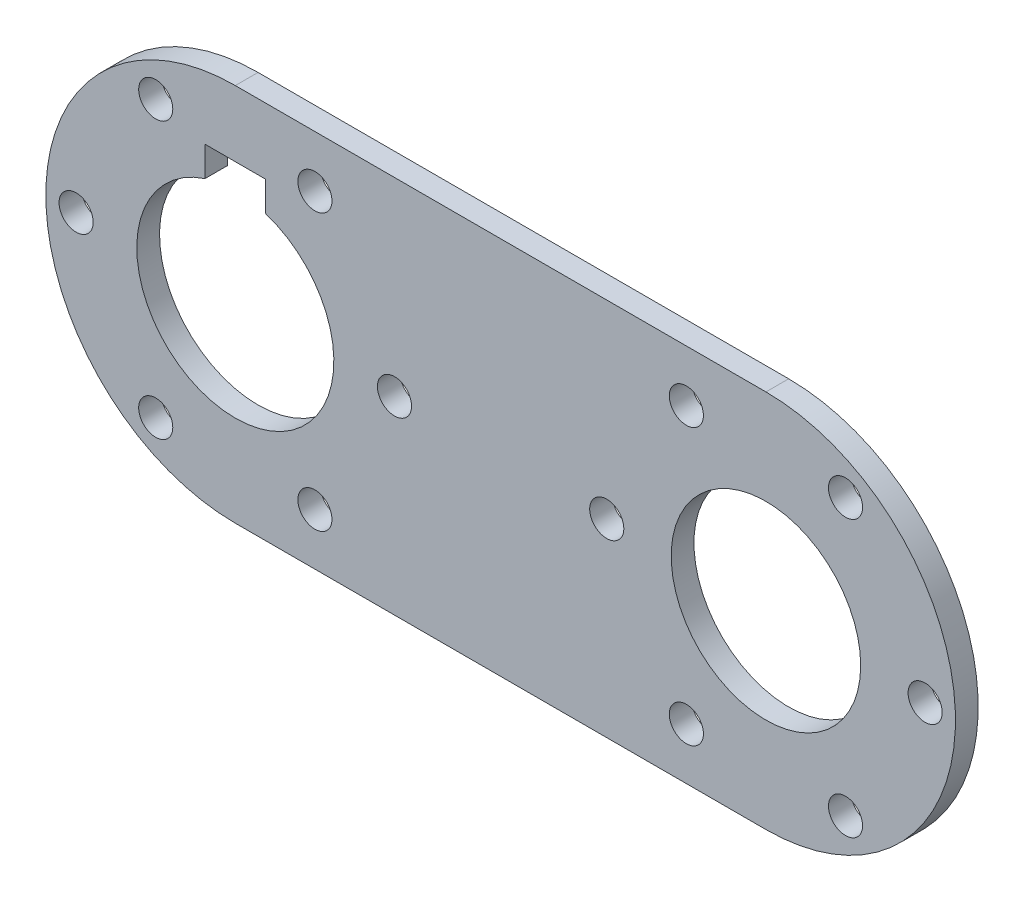
ISO-10303-21;
HEADER;
FILE_DESCRIPTION(('STEP AP214'),'2;1');
FILE_NAME('part.step','',(''),(''),'','','');
FILE_SCHEMA(('AUTOMOTIVE_DESIGN { 1 0 10303 214 1 1 1 1 }'));
ENDSEC;
DATA;
#1=APPLICATION_CONTEXT('core data for automotive mechanical design processes');
#2=APPLICATION_PROTOCOL_DEFINITION('international standard','automotive_design',2000,#1);
#3=PRODUCT_CONTEXT('',#1,'mechanical');
#4=PRODUCT('Part','Part','',(#3));
#5=PRODUCT_RELATED_PRODUCT_CATEGORY('part','',(#4));
#6=PRODUCT_DEFINITION_FORMATION('','',#4);
#7=PRODUCT_DEFINITION_CONTEXT('part definition',#1,'design');
#8=PRODUCT_DEFINITION('design','',#6,#7);
#9=PRODUCT_DEFINITION_SHAPE('','',#8);
#10=(LENGTH_UNIT() NAMED_UNIT(*) SI_UNIT(.MILLI.,.METRE.));
#11=(NAMED_UNIT(*) PLANE_ANGLE_UNIT() SI_UNIT($,.RADIAN.));
#12=(NAMED_UNIT(*) SI_UNIT($,.STERADIAN.) SOLID_ANGLE_UNIT());
#13=UNCERTAINTY_MEASURE_WITH_UNIT(LENGTH_MEASURE(1.E-05),#10,'distance_accuracy_value','');
#14=(GEOMETRIC_REPRESENTATION_CONTEXT(3) GLOBAL_UNCERTAINTY_ASSIGNED_CONTEXT((#13)) GLOBAL_UNIT_ASSIGNED_CONTEXT((#10,
#11,#12)) REPRESENTATION_CONTEXT('',''));
#15=CARTESIAN_POINT('',(0.,0.,0.));
#16=DIRECTION('',(0.,0.,1.));
#17=DIRECTION('',(1.,0.,0.));
#18=AXIS2_PLACEMENT_3D('',#15,#16,#17);
#19=CARTESIAN_POINT('',(0.,-25.,3.));
#20=DIRECTION('',(0.,-1.,0.));
#21=DIRECTION('',(1.,0.,0.));
#22=AXIS2_PLACEMENT_3D('',#19,#20,#21);
#23=PLANE('',#22);
#24=DIRECTION('',(-1.,0.,0.));
#25=VECTOR('',#24,1.);
#26=CARTESIAN_POINT('',(0.,-25.,0.));
#27=LINE('',#26,#25);
#28=CARTESIAN_POINT('',(70.,-25.,0.));
#29=VERTEX_POINT('',#28);
#30=CARTESIAN_POINT('',(0.,-25.,0.));
#31=VERTEX_POINT('',#30);
#32=EDGE_CURVE('E208',#29,#31,#27,.T.);
#33=ORIENTED_EDGE('',*,*,#32,.F.);
#34=DIRECTION('',(0.,0.,-1.));
#35=VECTOR('',#34,1.);
#36=CARTESIAN_POINT('',(70.,-25.,3.));
#37=LINE('',#36,#35);
#38=CARTESIAN_POINT('',(70.,-25.,3.));
#39=VERTEX_POINT('',#38);
#40=EDGE_CURVE('E11',#39,#29,#37,.T.);
#41=ORIENTED_EDGE('',*,*,#40,.F.);
#42=DIRECTION('',(-1.,0.,0.));
#43=VECTOR('',#42,1.);
#44=CARTESIAN_POINT('',(0.,-25.,3.));
#45=LINE('',#44,#43);
#46=CARTESIAN_POINT('',(0.,-25.,3.));
#47=VERTEX_POINT('',#46);
#48=EDGE_CURVE('E209',#39,#47,#45,.T.);
#49=ORIENTED_EDGE('',*,*,#48,.T.);
#50=DIRECTION('',(0.,0.,-1.));
#51=VECTOR('',#50,1.);
#52=CARTESIAN_POINT('',(0.,-25.,3.));
#53=LINE('',#52,#51);
#54=EDGE_CURVE('E223',#47,#31,#53,.T.);
#55=ORIENTED_EDGE('',*,*,#54,.T.);
#56=EDGE_LOOP('',(#33,#41,#49,#55));
#57=FACE_BOUND('',#56,.T.);
#58=ADVANCED_FACE('F37',(#57),#23,.T.);
#59=CARTESIAN_POINT('',(70.,0.,3.));
#60=DIRECTION('',(0.,0.,-1.));
#61=DIRECTION('',(-1.,0.,0.));
#62=AXIS2_PLACEMENT_3D('',#59,#60,#61);
#63=CYLINDRICAL_SURFACE('',#62,25.);
#64=CARTESIAN_POINT('',(70.,0.,0.));
#65=DIRECTION('',(0.,0.,1.));
#66=DIRECTION('',(1.,0.,0.));
#67=AXIS2_PLACEMENT_3D('',#64,#65,#66);
#68=CIRCLE('',#67,25.);
#69=CARTESIAN_POINT('',(70.,25.,0.));
#70=VERTEX_POINT('',#69);
#71=EDGE_CURVE('E226',#29,#70,#68,.T.);
#72=ORIENTED_EDGE('',*,*,#71,.T.);
#73=DIRECTION('',(0.,0.,-1.));
#74=VECTOR('',#73,1.);
#75=CARTESIAN_POINT('',(70.,25.,3.));
#76=LINE('',#75,#74);
#77=CARTESIAN_POINT('',(70.,25.,3.));
#78=VERTEX_POINT('',#77);
#79=EDGE_CURVE('E44',#78,#70,#76,.T.);
#80=ORIENTED_EDGE('',*,*,#79,.F.);
#81=CARTESIAN_POINT('',(70.,0.,3.));
#82=DIRECTION('',(0.,0.,1.));
#83=DIRECTION('',(1.,0.,0.));
#84=AXIS2_PLACEMENT_3D('',#81,#82,#83);
#85=CIRCLE('',#84,25.);
#86=EDGE_CURVE('E212',#39,#78,#85,.T.);
#87=ORIENTED_EDGE('',*,*,#86,.F.);
#88=ORIENTED_EDGE('',*,*,#40,.T.);
#89=EDGE_LOOP('',(#72,#80,#87,#88));
#90=FACE_BOUND('',#89,.T.);
#91=ADVANCED_FACE('F247',(#90),#63,.T.);
#92=CARTESIAN_POINT('',(0.,25.,3.));
#93=DIRECTION('',(0.,1.,0.));
#94=DIRECTION('',(-1.,0.,0.));
#95=AXIS2_PLACEMENT_3D('',#92,#93,#94);
#96=PLANE('',#95);
#97=DIRECTION('',(1.,0.,0.));
#98=VECTOR('',#97,1.);
#99=CARTESIAN_POINT('',(0.,25.,0.));
#100=LINE('',#99,#98);
#101=CARTESIAN_POINT('',(0.,25.,0.));
#102=VERTEX_POINT('',#101);
#103=EDGE_CURVE('E229',#102,#70,#100,.T.);
#104=ORIENTED_EDGE('',*,*,#103,.F.);
#105=DIRECTION('',(0.,0.,-1.));
#106=VECTOR('',#105,1.);
#107=CARTESIAN_POINT('',(0.,25.,3.));
#108=LINE('',#107,#106);
#109=CARTESIAN_POINT('',(0.,25.,3.));
#110=VERTEX_POINT('',#109);
#111=EDGE_CURVE('E238',#110,#102,#108,.T.);
#112=ORIENTED_EDGE('',*,*,#111,.F.);
#113=DIRECTION('',(1.,0.,0.));
#114=VECTOR('',#113,1.);
#115=CARTESIAN_POINT('',(0.,25.,3.));
#116=LINE('',#115,#114);
#117=EDGE_CURVE('E215',#110,#78,#116,.T.);
#118=ORIENTED_EDGE('',*,*,#117,.T.);
#119=ORIENTED_EDGE('',*,*,#79,.T.);
#120=EDGE_LOOP('',(#104,#112,#118,#119));
#121=FACE_BOUND('',#120,.T.);
#122=ADVANCED_FACE('F242',(#121),#96,.T.);
#123=CARTESIAN_POINT('',(0.,0.,3.));
#124=DIRECTION('',(0.,0.,-1.));
#125=DIRECTION('',(-1.,0.,0.));
#126=AXIS2_PLACEMENT_3D('',#123,#124,#125);
#127=CYLINDRICAL_SURFACE('',#126,25.);
#128=CARTESIAN_POINT('',(0.,0.,0.));
#129=DIRECTION('',(0.,0.,1.));
#130=DIRECTION('',(1.,0.,0.));
#131=AXIS2_PLACEMENT_3D('',#128,#129,#130);
#132=CIRCLE('',#131,25.);
#133=EDGE_CURVE('E232',#102,#31,#132,.T.);
#134=ORIENTED_EDGE('',*,*,#133,.T.);
#135=ORIENTED_EDGE('',*,*,#54,.F.);
#136=CARTESIAN_POINT('',(0.,0.,3.));
#137=DIRECTION('',(0.,0.,1.));
#138=DIRECTION('',(1.,0.,0.));
#139=AXIS2_PLACEMENT_3D('',#136,#137,#138);
#140=CIRCLE('',#139,25.);
#141=EDGE_CURVE('E218',#110,#47,#140,.T.);
#142=ORIENTED_EDGE('',*,*,#141,.F.);
#143=ORIENTED_EDGE('',*,*,#111,.T.);
#144=EDGE_LOOP('',(#134,#135,#142,#143));
#145=FACE_BOUND('',#144,.T.);
#146=ADVANCED_FACE('F254',(#145),#127,.T.);
#147=CARTESIAN_POINT('',(70.,0.,3.));
#148=DIRECTION('',(0.,0.,-1.));
#149=DIRECTION('',(-1.,0.,0.));
#150=AXIS2_PLACEMENT_3D('',#147,#148,#149);
#151=CYLINDRICAL_SURFACE('',#150,12.5);
#152=CARTESIAN_POINT('',(70.,0.,3.));
#153=DIRECTION('',(0.,0.,1.));
#154=DIRECTION('',(1.,0.,0.));
#155=AXIS2_PLACEMENT_3D('',#152,#153,#154);
#156=CIRCLE('',#155,12.5);
#157=CARTESIAN_POINT('',(82.5,0.,3.));
#158=VERTEX_POINT('',#157);
#159=EDGE_CURVE('E220',#158,#158,#156,.T.);
#160=ORIENTED_EDGE('',*,*,#159,.T.);
#161=EDGE_LOOP('',(#160));
#162=FACE_BOUND('',#161,.T.);
#163=CARTESIAN_POINT('',(70.,0.,0.));
#164=DIRECTION('',(0.,0.,1.));
#165=DIRECTION('',(1.,0.,0.));
#166=AXIS2_PLACEMENT_3D('',#163,#164,#165);
#167=CIRCLE('',#166,12.5);
#168=CARTESIAN_POINT('',(82.5,0.,0.));
#169=VERTEX_POINT('',#168);
#170=EDGE_CURVE('E213',#169,#169,#167,.T.);
#171=ORIENTED_EDGE('',*,*,#170,.F.);
#172=EDGE_LOOP('',(#171));
#173=FACE_BOUND('',#172,.T.);
#174=ADVANCED_FACE('F272',(#162,#173),#151,.F.);
#175=CARTESIAN_POINT('',(0.,0.,3.));
#176=DIRECTION('',(0.,0.,1.));
#177=DIRECTION('',(1.,0.,0.));
#178=AXIS2_PLACEMENT_3D('',#175,#176,#177);
#179=PLANE('',#178);
#180=DIRECTION('',(-1.,0.,0.));
#181=VECTOR('',#180,1.);
#182=CARTESIAN_POINT('',(3.99999999999999,16.3,3.));
#183=LINE('',#182,#181);
#184=CARTESIAN_POINT('',(3.99999999999999,16.3,3.));
#185=VERTEX_POINT('',#184);
#186=CARTESIAN_POINT('',(-4.00000000000001,16.3,3.));
#187=VERTEX_POINT('',#186);
#188=EDGE_CURVE('E51',#185,#187,#183,.T.);
#189=ORIENTED_EDGE('',*,*,#188,.F.);
#190=DIRECTION('',(0.,-1.,0.));
#191=VECTOR('',#190,1.);
#192=CARTESIAN_POINT('',(3.99999999999999,16.3,3.));
#193=LINE('',#192,#191);
#194=CARTESIAN_POINT('',(4.,12.369316876853,3.));
#195=VERTEX_POINT('',#194);
#196=EDGE_CURVE('E118',#185,#195,#193,.T.);
#197=ORIENTED_EDGE('',*,*,#196,.T.);
#198=CARTESIAN_POINT('',(0.,0.,3.));
#199=DIRECTION('',(0.,0.,1.));
#200=DIRECTION('',(1.,0.,0.));
#201=AXIS2_PLACEMENT_3D('',#198,#199,#200);
#202=CIRCLE('',#201,13.);
#203=CARTESIAN_POINT('',(-4.00000000000001,12.369316876853,3.));
#204=VERTEX_POINT('',#203);
#205=EDGE_CURVE('E121',#204,#195,#202,.T.);
#206=ORIENTED_EDGE('',*,*,#205,.F.);
#207=DIRECTION('',(0.,1.,0.));
#208=VECTOR('',#207,1.);
#209=CARTESIAN_POINT('',(-4.00000000000001,12.369316876853,3.));
#210=LINE('',#209,#208);
#211=EDGE_CURVE('E127',#204,#187,#210,.T.);
#212=ORIENTED_EDGE('',*,*,#211,.T.);
#213=EDGE_LOOP('',(#189,#197,#206,#212));
#214=FACE_BOUND('',#213,.T.);
#215=CARTESIAN_POINT('',(-21.,0.,3.));
#216=DIRECTION('',(0.,0.,1.));
#217=DIRECTION('',(1.,0.,0.));
#218=AXIS2_PLACEMENT_3D('',#215,#216,#217);
#219=CIRCLE('',#218,2.25);
#220=CARTESIAN_POINT('',(-18.75,0.,3.));
#221=VERTEX_POINT('',#220);
#222=EDGE_CURVE('E133',#221,#221,#219,.T.);
#223=ORIENTED_EDGE('',*,*,#222,.F.);
#224=EDGE_LOOP('',(#223));
#225=FACE_BOUND('',#224,.T.);
#226=CARTESIAN_POINT('',(91.,0.,3.));
#227=DIRECTION('',(0.,0.,1.));
#228=DIRECTION('',(1.,0.,0.));
#229=AXIS2_PLACEMENT_3D('',#226,#227,#228);
#230=CIRCLE('',#229,2.25);
#231=CARTESIAN_POINT('',(93.25,0.,3.));
#232=VERTEX_POINT('',#231);
#233=EDGE_CURVE('E142',#232,#232,#230,.T.);
#234=ORIENTED_EDGE('',*,*,#233,.F.);
#235=EDGE_LOOP('',(#234));
#236=FACE_BOUND('',#235,.T.);
#237=CARTESIAN_POINT('',(-10.5,18.1865334794732,3.));
#238=DIRECTION('',(0.,0.,1.));
#239=DIRECTION('',(1.,0.,0.));
#240=AXIS2_PLACEMENT_3D('',#237,#238,#239);
#241=CIRCLE('',#240,2.25);
#242=CARTESIAN_POINT('',(-8.24999999999996,18.1865334794732,3.));
#243=VERTEX_POINT('',#242);
#244=EDGE_CURVE('E148',#243,#243,#241,.T.);
#245=ORIENTED_EDGE('',*,*,#244,.F.);
#246=EDGE_LOOP('',(#245));
#247=FACE_BOUND('',#246,.T.);
#248=CARTESIAN_POINT('',(10.5000000000001,18.1865334794732,3.));
#249=DIRECTION('',(0.,0.,1.));
#250=DIRECTION('',(1.,0.,0.));
#251=AXIS2_PLACEMENT_3D('',#248,#249,#250);
#252=CIRCLE('',#251,2.25);
#253=CARTESIAN_POINT('',(12.7500000000001,18.1865334794732,3.));
#254=VERTEX_POINT('',#253);
#255=EDGE_CURVE('E154',#254,#254,#252,.T.);
#256=ORIENTED_EDGE('',*,*,#255,.F.);
#257=EDGE_LOOP('',(#256));
#258=FACE_BOUND('',#257,.T.);
#259=CARTESIAN_POINT('',(21.,-1.46642216231412E-13,3.));
#260=DIRECTION('',(0.,0.,1.));
#261=DIRECTION('',(1.,0.,0.));
#262=AXIS2_PLACEMENT_3D('',#259,#260,#261);
#263=CIRCLE('',#262,2.25);
#264=CARTESIAN_POINT('',(23.25,-1.46642216231412E-13,3.));
#265=VERTEX_POINT('',#264);
#266=EDGE_CURVE('E160',#265,#265,#263,.T.);
#267=ORIENTED_EDGE('',*,*,#266,.F.);
#268=EDGE_LOOP('',(#267));
#269=FACE_BOUND('',#268,.T.);
#270=CARTESIAN_POINT('',(10.4999999999998,-18.1865334794733,3.));
#271=DIRECTION('',(0.,0.,1.));
#272=DIRECTION('',(1.,0.,0.));
#273=AXIS2_PLACEMENT_3D('',#270,#271,#272);
#274=CIRCLE('',#273,2.25);
#275=CARTESIAN_POINT('',(12.7499999999998,-18.1865334794733,3.));
#276=VERTEX_POINT('',#275);
#277=EDGE_CURVE('E166',#276,#276,#274,.T.);
#278=ORIENTED_EDGE('',*,*,#277,.F.);
#279=EDGE_LOOP('',(#278));
#280=FACE_BOUND('',#279,.T.);
#281=CARTESIAN_POINT('',(-10.5000000000002,-18.1865334794731,3.));
#282=DIRECTION('',(0.,0.,1.));
#283=DIRECTION('',(1.,0.,0.));
#284=AXIS2_PLACEMENT_3D('',#281,#282,#283);
#285=CIRCLE('',#284,2.25);
#286=CARTESIAN_POINT('',(-8.25000000000021,-18.1865334794731,3.));
#287=VERTEX_POINT('',#286);
#288=EDGE_CURVE('E172',#287,#287,#285,.T.);
#289=ORIENTED_EDGE('',*,*,#288,.F.);
#290=EDGE_LOOP('',(#289));
#291=FACE_BOUND('',#290,.T.);
#292=CARTESIAN_POINT('',(80.5,-18.1865334794732,3.));
#293=DIRECTION('',(0.,0.,1.));
#294=DIRECTION('',(1.,0.,0.));
#295=AXIS2_PLACEMENT_3D('',#292,#293,#294);
#296=CIRCLE('',#295,2.25);
#297=CARTESIAN_POINT('',(82.75,-18.1865334794732,3.));
#298=VERTEX_POINT('',#297);
#299=EDGE_CURVE('E178',#298,#298,#296,.T.);
#300=ORIENTED_EDGE('',*,*,#299,.F.);
#301=EDGE_LOOP('',(#300));
#302=FACE_BOUND('',#301,.T.);
#303=CARTESIAN_POINT('',(59.4999999999999,-18.1865334794732,3.));
#304=DIRECTION('',(0.,0.,1.));
#305=DIRECTION('',(1.,0.,0.));
#306=AXIS2_PLACEMENT_3D('',#303,#304,#305);
#307=CIRCLE('',#306,2.25);
#308=CARTESIAN_POINT('',(61.7499999999999,-18.1865334794732,3.));
#309=VERTEX_POINT('',#308);
#310=EDGE_CURVE('E184',#309,#309,#307,.T.);
#311=ORIENTED_EDGE('',*,*,#310,.F.);
#312=EDGE_LOOP('',(#311));
#313=FACE_BOUND('',#312,.T.);
#314=CARTESIAN_POINT('',(49.,1.51785732787831E-13,3.));
#315=DIRECTION('',(0.,0.,1.));
#316=DIRECTION('',(1.,0.,0.));
#317=AXIS2_PLACEMENT_3D('',#314,#315,#316);
#318=CIRCLE('',#317,2.25);
#319=CARTESIAN_POINT('',(51.25,1.51785732787831E-13,3.));
#320=VERTEX_POINT('',#319);
#321=EDGE_CURVE('E190',#320,#320,#318,.T.);
#322=ORIENTED_EDGE('',*,*,#321,.F.);
#323=EDGE_LOOP('',(#322));
#324=FACE_BOUND('',#323,.T.);
#325=CARTESIAN_POINT('',(59.5000000000002,18.1865334794733,3.));
#326=DIRECTION('',(0.,0.,1.));
#327=DIRECTION('',(1.,0.,0.));
#328=AXIS2_PLACEMENT_3D('',#325,#326,#327);
#329=CIRCLE('',#328,2.25);
#330=CARTESIAN_POINT('',(61.7500000000002,18.1865334794733,3.));
#331=VERTEX_POINT('',#330);
#332=EDGE_CURVE('E196',#331,#331,#329,.T.);
#333=ORIENTED_EDGE('',*,*,#332,.F.);
#334=EDGE_LOOP('',(#333));
#335=FACE_BOUND('',#334,.T.);
#336=CARTESIAN_POINT('',(80.5000000000002,18.1865334794731,3.));
#337=DIRECTION('',(0.,0.,1.));
#338=DIRECTION('',(1.,0.,0.));
#339=AXIS2_PLACEMENT_3D('',#336,#337,#338);
#340=CIRCLE('',#339,2.25);
#341=CARTESIAN_POINT('',(82.7500000000002,18.1865334794731,3.));
#342=VERTEX_POINT('',#341);
#343=EDGE_CURVE('E202',#342,#342,#340,.T.);
#344=ORIENTED_EDGE('',*,*,#343,.F.);
#345=EDGE_LOOP('',(#344));
#346=FACE_BOUND('',#345,.T.);
#347=ORIENTED_EDGE('',*,*,#48,.F.);
#348=ORIENTED_EDGE('',*,*,#86,.T.);
#349=ORIENTED_EDGE('',*,*,#117,.F.);
#350=ORIENTED_EDGE('',*,*,#141,.T.);
#351=EDGE_LOOP('',(#347,#348,#349,#350));
#352=FACE_BOUND('',#351,.T.);
#353=ORIENTED_EDGE('',*,*,#159,.F.);
#354=EDGE_LOOP('',(#353));
#355=FACE_BOUND('',#354,.T.);
#356=ADVANCED_FACE('F258',(#214,#225,#236,#247,#258,#269,#280,#291,#302,#313,#324,#335,#346,
#352,#355),#179,.T.);
#357=CARTESIAN_POINT('',(0.,0.,0.));
#358=DIRECTION('',(0.,0.,1.));
#359=DIRECTION('',(1.,0.,0.));
#360=AXIS2_PLACEMENT_3D('',#357,#358,#359);
#361=PLANE('',#360);
#362=DIRECTION('',(0.,-1.,0.));
#363=VECTOR('',#362,1.);
#364=CARTESIAN_POINT('',(3.99999999999999,16.3,0.));
#365=LINE('',#364,#363);
#366=CARTESIAN_POINT('',(3.99999999999999,16.3,0.));
#367=VERTEX_POINT('',#366);
#368=CARTESIAN_POINT('',(4.,12.369316876853,0.));
#369=VERTEX_POINT('',#368);
#370=EDGE_CURVE('E114',#367,#369,#365,.T.);
#371=ORIENTED_EDGE('',*,*,#370,.F.);
#372=DIRECTION('',(-1.,0.,0.));
#373=VECTOR('',#372,1.);
#374=CARTESIAN_POINT('',(3.99999999999999,16.3,0.));
#375=LINE('',#374,#373);
#376=CARTESIAN_POINT('',(-4.00000000000001,16.3,0.));
#377=VERTEX_POINT('',#376);
#378=EDGE_CURVE('E109',#367,#377,#375,.T.);
#379=ORIENTED_EDGE('',*,*,#378,.T.);
#380=DIRECTION('',(0.,1.,0.));
#381=VECTOR('',#380,1.);
#382=CARTESIAN_POINT('',(-4.00000000000001,12.369316876853,0.));
#383=LINE('',#382,#381);
#384=CARTESIAN_POINT('',(-4.00000000000001,12.369316876853,0.));
#385=VERTEX_POINT('',#384);
#386=EDGE_CURVE('E101',#385,#377,#383,.T.);
#387=ORIENTED_EDGE('',*,*,#386,.F.);
#388=CARTESIAN_POINT('',(0.,0.,0.));
#389=DIRECTION('',(0.,0.,1.));
#390=DIRECTION('',(1.,0.,0.));
#391=AXIS2_PLACEMENT_3D('',#388,#389,#390);
#392=CIRCLE('',#391,13.);
#393=EDGE_CURVE('E59',#385,#369,#392,.T.);
#394=ORIENTED_EDGE('',*,*,#393,.T.);
#395=EDGE_LOOP('',(#371,#379,#387,#394));
#396=FACE_BOUND('',#395,.T.);
#397=CARTESIAN_POINT('',(-21.,0.,0.));
#398=DIRECTION('',(0.,0.,1.));
#399=DIRECTION('',(1.,0.,0.));
#400=AXIS2_PLACEMENT_3D('',#397,#398,#399);
#401=CIRCLE('',#400,2.25);
#402=CARTESIAN_POINT('',(-18.75,0.,0.));
#403=VERTEX_POINT('',#402);
#404=EDGE_CURVE('E139',#403,#403,#401,.T.);
#405=ORIENTED_EDGE('',*,*,#404,.T.);
#406=EDGE_LOOP('',(#405));
#407=FACE_BOUND('',#406,.T.);
#408=CARTESIAN_POINT('',(91.,0.,0.));
#409=DIRECTION('',(0.,0.,1.));
#410=DIRECTION('',(1.,0.,0.));
#411=AXIS2_PLACEMENT_3D('',#408,#409,#410);
#412=CIRCLE('',#411,2.25);
#413=CARTESIAN_POINT('',(93.25,0.,0.));
#414=VERTEX_POINT('',#413);
#415=EDGE_CURVE('E145',#414,#414,#412,.T.);
#416=ORIENTED_EDGE('',*,*,#415,.T.);
#417=EDGE_LOOP('',(#416));
#418=FACE_BOUND('',#417,.T.);
#419=CARTESIAN_POINT('',(-10.5,18.1865334794732,0.));
#420=DIRECTION('',(0.,0.,1.));
#421=DIRECTION('',(1.,0.,0.));
#422=AXIS2_PLACEMENT_3D('',#419,#420,#421);
#423=CIRCLE('',#422,2.25);
#424=CARTESIAN_POINT('',(-8.24999999999996,18.1865334794732,0.));
#425=VERTEX_POINT('',#424);
#426=EDGE_CURVE('E151',#425,#425,#423,.T.);
#427=ORIENTED_EDGE('',*,*,#426,.T.);
#428=EDGE_LOOP('',(#427));
#429=FACE_BOUND('',#428,.T.);
#430=CARTESIAN_POINT('',(10.5000000000001,18.1865334794732,0.));
#431=DIRECTION('',(0.,0.,1.));
#432=DIRECTION('',(1.,0.,0.));
#433=AXIS2_PLACEMENT_3D('',#430,#431,#432);
#434=CIRCLE('',#433,2.25);
#435=CARTESIAN_POINT('',(12.7500000000001,18.1865334794732,0.));
#436=VERTEX_POINT('',#435);
#437=EDGE_CURVE('E157',#436,#436,#434,.T.);
#438=ORIENTED_EDGE('',*,*,#437,.T.);
#439=EDGE_LOOP('',(#438));
#440=FACE_BOUND('',#439,.T.);
#441=CARTESIAN_POINT('',(21.,-1.46642216231412E-13,0.));
#442=DIRECTION('',(0.,0.,1.));
#443=DIRECTION('',(1.,0.,0.));
#444=AXIS2_PLACEMENT_3D('',#441,#442,#443);
#445=CIRCLE('',#444,2.25);
#446=CARTESIAN_POINT('',(23.25,-1.46642216231412E-13,0.));
#447=VERTEX_POINT('',#446);
#448=EDGE_CURVE('E163',#447,#447,#445,.T.);
#449=ORIENTED_EDGE('',*,*,#448,.T.);
#450=EDGE_LOOP('',(#449));
#451=FACE_BOUND('',#450,.T.);
#452=CARTESIAN_POINT('',(10.4999999999998,-18.1865334794733,0.));
#453=DIRECTION('',(0.,0.,1.));
#454=DIRECTION('',(1.,0.,0.));
#455=AXIS2_PLACEMENT_3D('',#452,#453,#454);
#456=CIRCLE('',#455,2.25);
#457=CARTESIAN_POINT('',(12.7499999999998,-18.1865334794733,0.));
#458=VERTEX_POINT('',#457);
#459=EDGE_CURVE('E169',#458,#458,#456,.T.);
#460=ORIENTED_EDGE('',*,*,#459,.T.);
#461=EDGE_LOOP('',(#460));
#462=FACE_BOUND('',#461,.T.);
#463=CARTESIAN_POINT('',(-10.5000000000002,-18.1865334794731,0.));
#464=DIRECTION('',(0.,0.,1.));
#465=DIRECTION('',(1.,0.,0.));
#466=AXIS2_PLACEMENT_3D('',#463,#464,#465);
#467=CIRCLE('',#466,2.25);
#468=CARTESIAN_POINT('',(-8.25000000000021,-18.1865334794731,0.));
#469=VERTEX_POINT('',#468);
#470=EDGE_CURVE('E175',#469,#469,#467,.T.);
#471=ORIENTED_EDGE('',*,*,#470,.T.);
#472=EDGE_LOOP('',(#471));
#473=FACE_BOUND('',#472,.T.);
#474=CARTESIAN_POINT('',(80.5,-18.1865334794732,0.));
#475=DIRECTION('',(0.,0.,1.));
#476=DIRECTION('',(1.,0.,0.));
#477=AXIS2_PLACEMENT_3D('',#474,#475,#476);
#478=CIRCLE('',#477,2.25);
#479=CARTESIAN_POINT('',(82.75,-18.1865334794732,0.));
#480=VERTEX_POINT('',#479);
#481=EDGE_CURVE('E181',#480,#480,#478,.T.);
#482=ORIENTED_EDGE('',*,*,#481,.T.);
#483=EDGE_LOOP('',(#482));
#484=FACE_BOUND('',#483,.T.);
#485=CARTESIAN_POINT('',(59.4999999999999,-18.1865334794732,0.));
#486=DIRECTION('',(0.,0.,1.));
#487=DIRECTION('',(1.,0.,0.));
#488=AXIS2_PLACEMENT_3D('',#485,#486,#487);
#489=CIRCLE('',#488,2.25);
#490=CARTESIAN_POINT('',(61.7499999999999,-18.1865334794732,0.));
#491=VERTEX_POINT('',#490);
#492=EDGE_CURVE('E187',#491,#491,#489,.T.);
#493=ORIENTED_EDGE('',*,*,#492,.T.);
#494=EDGE_LOOP('',(#493));
#495=FACE_BOUND('',#494,.T.);
#496=CARTESIAN_POINT('',(49.,1.51785732787831E-13,0.));
#497=DIRECTION('',(0.,0.,1.));
#498=DIRECTION('',(1.,0.,0.));
#499=AXIS2_PLACEMENT_3D('',#496,#497,#498);
#500=CIRCLE('',#499,2.25);
#501=CARTESIAN_POINT('',(51.25,1.51785732787831E-13,0.));
#502=VERTEX_POINT('',#501);
#503=EDGE_CURVE('E193',#502,#502,#500,.T.);
#504=ORIENTED_EDGE('',*,*,#503,.T.);
#505=EDGE_LOOP('',(#504));
#506=FACE_BOUND('',#505,.T.);
#507=CARTESIAN_POINT('',(59.5000000000002,18.1865334794733,0.));
#508=DIRECTION('',(0.,0.,1.));
#509=DIRECTION('',(1.,0.,0.));
#510=AXIS2_PLACEMENT_3D('',#507,#508,#509);
#511=CIRCLE('',#510,2.25);
#512=CARTESIAN_POINT('',(61.7500000000002,18.1865334794733,0.));
#513=VERTEX_POINT('',#512);
#514=EDGE_CURVE('E199',#513,#513,#511,.T.);
#515=ORIENTED_EDGE('',*,*,#514,.T.);
#516=EDGE_LOOP('',(#515));
#517=FACE_BOUND('',#516,.T.);
#518=CARTESIAN_POINT('',(80.5000000000002,18.1865334794731,0.));
#519=DIRECTION('',(0.,0.,1.));
#520=DIRECTION('',(1.,0.,0.));
#521=AXIS2_PLACEMENT_3D('',#518,#519,#520);
#522=CIRCLE('',#521,2.25);
#523=CARTESIAN_POINT('',(82.7500000000002,18.1865334794731,0.));
#524=VERTEX_POINT('',#523);
#525=EDGE_CURVE('E205',#524,#524,#522,.T.);
#526=ORIENTED_EDGE('',*,*,#525,.T.);
#527=EDGE_LOOP('',(#526));
#528=FACE_BOUND('',#527,.T.);
#529=ORIENTED_EDGE('',*,*,#32,.T.);
#530=ORIENTED_EDGE('',*,*,#133,.F.);
#531=ORIENTED_EDGE('',*,*,#103,.T.);
#532=ORIENTED_EDGE('',*,*,#71,.F.);
#533=EDGE_LOOP('',(#529,#530,#531,#532));
#534=FACE_BOUND('',#533,.T.);
#535=ORIENTED_EDGE('',*,*,#170,.T.);
#536=EDGE_LOOP('',(#535));
#537=FACE_BOUND('',#536,.T.);
#538=ADVANCED_FACE('F116',(#396,#407,#418,#429,#440,#451,#462,#473,#484,#495,#506,#517,#528,
#534,#537),#361,.F.);
#539=CARTESIAN_POINT('',(80.5000000000002,18.1865334794731,3.));
#540=DIRECTION('',(0.,0.,1.));
#541=DIRECTION('',(1.,0.,0.));
#542=AXIS2_PLACEMENT_3D('',#539,#540,#541);
#543=CYLINDRICAL_SURFACE('',#542,2.25);
#544=ORIENTED_EDGE('',*,*,#525,.F.);
#545=EDGE_LOOP('',(#544));
#546=FACE_BOUND('',#545,.T.);
#547=ORIENTED_EDGE('',*,*,#343,.T.);
#548=EDGE_LOOP('',(#547));
#549=FACE_BOUND('',#548,.T.);
#550=ADVANCED_FACE('F278',(#546,#549),#543,.F.);
#551=CARTESIAN_POINT('',(59.5000000000002,18.1865334794733,3.));
#552=DIRECTION('',(0.,0.,1.));
#553=DIRECTION('',(1.,0.,0.));
#554=AXIS2_PLACEMENT_3D('',#551,#552,#553);
#555=CYLINDRICAL_SURFACE('',#554,2.25);
#556=ORIENTED_EDGE('',*,*,#514,.F.);
#557=EDGE_LOOP('',(#556));
#558=FACE_BOUND('',#557,.T.);
#559=ORIENTED_EDGE('',*,*,#332,.T.);
#560=EDGE_LOOP('',(#559));
#561=FACE_BOUND('',#560,.T.);
#562=ADVANCED_FACE('F284',(#558,#561),#555,.F.);
#563=CARTESIAN_POINT('',(49.,1.51785732787831E-13,3.));
#564=DIRECTION('',(0.,0.,1.));
#565=DIRECTION('',(1.,0.,0.));
#566=AXIS2_PLACEMENT_3D('',#563,#564,#565);
#567=CYLINDRICAL_SURFACE('',#566,2.25);
#568=ORIENTED_EDGE('',*,*,#503,.F.);
#569=EDGE_LOOP('',(#568));
#570=FACE_BOUND('',#569,.T.);
#571=ORIENTED_EDGE('',*,*,#321,.T.);
#572=EDGE_LOOP('',(#571));
#573=FACE_BOUND('',#572,.T.);
#574=ADVANCED_FACE('F288',(#570,#573),#567,.F.);
#575=CARTESIAN_POINT('',(59.4999999999999,-18.1865334794732,3.));
#576=DIRECTION('',(0.,0.,1.));
#577=DIRECTION('',(1.,0.,0.));
#578=AXIS2_PLACEMENT_3D('',#575,#576,#577);
#579=CYLINDRICAL_SURFACE('',#578,2.25);
#580=ORIENTED_EDGE('',*,*,#492,.F.);
#581=EDGE_LOOP('',(#580));
#582=FACE_BOUND('',#581,.T.);
#583=ORIENTED_EDGE('',*,*,#310,.T.);
#584=EDGE_LOOP('',(#583));
#585=FACE_BOUND('',#584,.T.);
#586=ADVANCED_FACE('F292',(#582,#585),#579,.F.);
#587=CARTESIAN_POINT('',(80.5,-18.1865334794732,3.));
#588=DIRECTION('',(0.,0.,1.));
#589=DIRECTION('',(1.,0.,0.));
#590=AXIS2_PLACEMENT_3D('',#587,#588,#589);
#591=CYLINDRICAL_SURFACE('',#590,2.25);
#592=ORIENTED_EDGE('',*,*,#481,.F.);
#593=EDGE_LOOP('',(#592));
#594=FACE_BOUND('',#593,.T.);
#595=ORIENTED_EDGE('',*,*,#299,.T.);
#596=EDGE_LOOP('',(#595));
#597=FACE_BOUND('',#596,.T.);
#598=ADVANCED_FACE('F296',(#594,#597),#591,.F.);
#599=CARTESIAN_POINT('',(-10.5000000000002,-18.1865334794731,3.));
#600=DIRECTION('',(0.,0.,1.));
#601=DIRECTION('',(1.,0.,0.));
#602=AXIS2_PLACEMENT_3D('',#599,#600,#601);
#603=CYLINDRICAL_SURFACE('',#602,2.25);
#604=ORIENTED_EDGE('',*,*,#470,.F.);
#605=EDGE_LOOP('',(#604));
#606=FACE_BOUND('',#605,.T.);
#607=ORIENTED_EDGE('',*,*,#288,.T.);
#608=EDGE_LOOP('',(#607));
#609=FACE_BOUND('',#608,.T.);
#610=ADVANCED_FACE('F300',(#606,#609),#603,.F.);
#611=CARTESIAN_POINT('',(10.4999999999998,-18.1865334794733,3.));
#612=DIRECTION('',(0.,0.,1.));
#613=DIRECTION('',(1.,0.,0.));
#614=AXIS2_PLACEMENT_3D('',#611,#612,#613);
#615=CYLINDRICAL_SURFACE('',#614,2.25);
#616=ORIENTED_EDGE('',*,*,#459,.F.);
#617=EDGE_LOOP('',(#616));
#618=FACE_BOUND('',#617,.T.);
#619=ORIENTED_EDGE('',*,*,#277,.T.);
#620=EDGE_LOOP('',(#619));
#621=FACE_BOUND('',#620,.T.);
#622=ADVANCED_FACE('F304',(#618,#621),#615,.F.);
#623=CARTESIAN_POINT('',(21.,-1.46642216231412E-13,3.));
#624=DIRECTION('',(0.,0.,1.));
#625=DIRECTION('',(1.,0.,0.));
#626=AXIS2_PLACEMENT_3D('',#623,#624,#625);
#627=CYLINDRICAL_SURFACE('',#626,2.25);
#628=ORIENTED_EDGE('',*,*,#448,.F.);
#629=EDGE_LOOP('',(#628));
#630=FACE_BOUND('',#629,.T.);
#631=ORIENTED_EDGE('',*,*,#266,.T.);
#632=EDGE_LOOP('',(#631));
#633=FACE_BOUND('',#632,.T.);
#634=ADVANCED_FACE('F308',(#630,#633),#627,.F.);
#635=CARTESIAN_POINT('',(10.5000000000001,18.1865334794732,3.));
#636=DIRECTION('',(0.,0.,1.));
#637=DIRECTION('',(1.,0.,0.));
#638=AXIS2_PLACEMENT_3D('',#635,#636,#637);
#639=CYLINDRICAL_SURFACE('',#638,2.25);
#640=ORIENTED_EDGE('',*,*,#437,.F.);
#641=EDGE_LOOP('',(#640));
#642=FACE_BOUND('',#641,.T.);
#643=ORIENTED_EDGE('',*,*,#255,.T.);
#644=EDGE_LOOP('',(#643));
#645=FACE_BOUND('',#644,.T.);
#646=ADVANCED_FACE('F312',(#642,#645),#639,.F.);
#647=CARTESIAN_POINT('',(-10.5,18.1865334794732,3.));
#648=DIRECTION('',(0.,0.,1.));
#649=DIRECTION('',(1.,0.,0.));
#650=AXIS2_PLACEMENT_3D('',#647,#648,#649);
#651=CYLINDRICAL_SURFACE('',#650,2.25);
#652=ORIENTED_EDGE('',*,*,#426,.F.);
#653=EDGE_LOOP('',(#652));
#654=FACE_BOUND('',#653,.T.);
#655=ORIENTED_EDGE('',*,*,#244,.T.);
#656=EDGE_LOOP('',(#655));
#657=FACE_BOUND('',#656,.T.);
#658=ADVANCED_FACE('F316',(#654,#657),#651,.F.);
#659=CARTESIAN_POINT('',(91.,0.,3.));
#660=DIRECTION('',(0.,0.,1.));
#661=DIRECTION('',(1.,0.,0.));
#662=AXIS2_PLACEMENT_3D('',#659,#660,#661);
#663=CYLINDRICAL_SURFACE('',#662,2.25);
#664=ORIENTED_EDGE('',*,*,#415,.F.);
#665=EDGE_LOOP('',(#664));
#666=FACE_BOUND('',#665,.T.);
#667=ORIENTED_EDGE('',*,*,#233,.T.);
#668=EDGE_LOOP('',(#667));
#669=FACE_BOUND('',#668,.T.);
#670=ADVANCED_FACE('F320',(#666,#669),#663,.F.);
#671=CARTESIAN_POINT('',(-21.,0.,3.));
#672=DIRECTION('',(0.,0.,1.));
#673=DIRECTION('',(1.,0.,0.));
#674=AXIS2_PLACEMENT_3D('',#671,#672,#673);
#675=CYLINDRICAL_SURFACE('',#674,2.25);
#676=ORIENTED_EDGE('',*,*,#404,.F.);
#677=EDGE_LOOP('',(#676));
#678=FACE_BOUND('',#677,.T.);
#679=ORIENTED_EDGE('',*,*,#222,.T.);
#680=EDGE_LOOP('',(#679));
#681=FACE_BOUND('',#680,.T.);
#682=ADVANCED_FACE('F324',(#678,#681),#675,.F.);
#683=CARTESIAN_POINT('',(3.99999999999999,16.3,0.));
#684=DIRECTION('',(0.,1.,0.));
#685=DIRECTION('',(-1.,0.,0.));
#686=AXIS2_PLACEMENT_3D('',#683,#684,#685);
#687=PLANE('',#686);
#688=ORIENTED_EDGE('',*,*,#188,.T.);
#689=DIRECTION('',(0.,0.,1.));
#690=VECTOR('',#689,1.);
#691=CARTESIAN_POINT('',(-4.00000000000001,16.3,0.));
#692=LINE('',#691,#690);
#693=EDGE_CURVE('E104',#377,#187,#692,.T.);
#694=ORIENTED_EDGE('',*,*,#693,.F.);
#695=ORIENTED_EDGE('',*,*,#378,.F.);
#696=DIRECTION('',(0.,0.,1.));
#697=VECTOR('',#696,1.);
#698=CARTESIAN_POINT('',(3.99999999999999,16.3,0.));
#699=LINE('',#698,#697);
#700=EDGE_CURVE('E131',#367,#185,#699,.T.);
#701=ORIENTED_EDGE('',*,*,#700,.T.);
#702=EDGE_LOOP('',(#688,#694,#695,#701));
#703=FACE_BOUND('',#702,.T.);
#704=ADVANCED_FACE('F112',(#703),#687,.F.);
#705=CARTESIAN_POINT('',(3.99999999999999,16.3,0.));
#706=DIRECTION('',(-1.,0.,0.));
#707=DIRECTION('',(0.,-1.,0.));
#708=AXIS2_PLACEMENT_3D('',#705,#706,#707);
#709=PLANE('',#708);
#710=ORIENTED_EDGE('',*,*,#196,.F.);
#711=ORIENTED_EDGE('',*,*,#700,.F.);
#712=ORIENTED_EDGE('',*,*,#370,.T.);
#713=DIRECTION('',(0.,0.,1.));
#714=VECTOR('',#713,1.);
#715=CARTESIAN_POINT('',(4.,12.369316876853,0.));
#716=LINE('',#715,#714);
#717=EDGE_CURVE('E134',#369,#195,#716,.T.);
#718=ORIENTED_EDGE('',*,*,#717,.T.);
#719=EDGE_LOOP('',(#710,#711,#712,#718));
#720=FACE_BOUND('',#719,.T.);
#721=ADVANCED_FACE('F331',(#720),#709,.T.);
#722=CARTESIAN_POINT('',(0.,0.,0.));
#723=DIRECTION('',(0.,0.,1.));
#724=DIRECTION('',(1.,0.,0.));
#725=AXIS2_PLACEMENT_3D('',#722,#723,#724);
#726=CYLINDRICAL_SURFACE('',#725,13.);
#727=ORIENTED_EDGE('',*,*,#205,.T.);
#728=ORIENTED_EDGE('',*,*,#717,.F.);
#729=ORIENTED_EDGE('',*,*,#393,.F.);
#730=DIRECTION('',(0.,0.,1.));
#731=VECTOR('',#730,1.);
#732=CARTESIAN_POINT('',(-4.00000000000001,12.369316876853,0.));
#733=LINE('',#732,#731);
#734=EDGE_CURVE('E106',#385,#204,#733,.T.);
#735=ORIENTED_EDGE('',*,*,#734,.T.);
#736=EDGE_LOOP('',(#727,#728,#729,#735));
#737=FACE_BOUND('',#736,.T.);
#738=ADVANCED_FACE('F334',(#737),#726,.F.);
#739=CARTESIAN_POINT('',(-4.00000000000001,12.369316876853,0.));
#740=DIRECTION('',(1.,0.,0.));
#741=DIRECTION('',(0.,1.,0.));
#742=AXIS2_PLACEMENT_3D('',#739,#740,#741);
#743=PLANE('',#742);
#744=ORIENTED_EDGE('',*,*,#211,.F.);
#745=ORIENTED_EDGE('',*,*,#734,.F.);
#746=ORIENTED_EDGE('',*,*,#386,.T.);
#747=ORIENTED_EDGE('',*,*,#693,.T.);
#748=EDGE_LOOP('',(#744,#745,#746,#747));
#749=FACE_BOUND('',#748,.T.);
#750=ADVANCED_FACE('F103',(#749),#743,.T.);
#751=CLOSED_SHELL('',(#58,#91,#122,#146,#174,#356,#538,#550,#562,#574,#586,#598,#610,#622,#634,
#646,#658,#670,#682,#704,#721,#738,#750));
#752=MANIFOLD_SOLID_BREP('B2',#751);
#753=ADVANCED_BREP_SHAPE_REPRESENTATION('',(#18,#752),#14);
#754=SHAPE_DEFINITION_REPRESENTATION(#9,#753);
ENDSEC;
END-ISO-10303-21;
